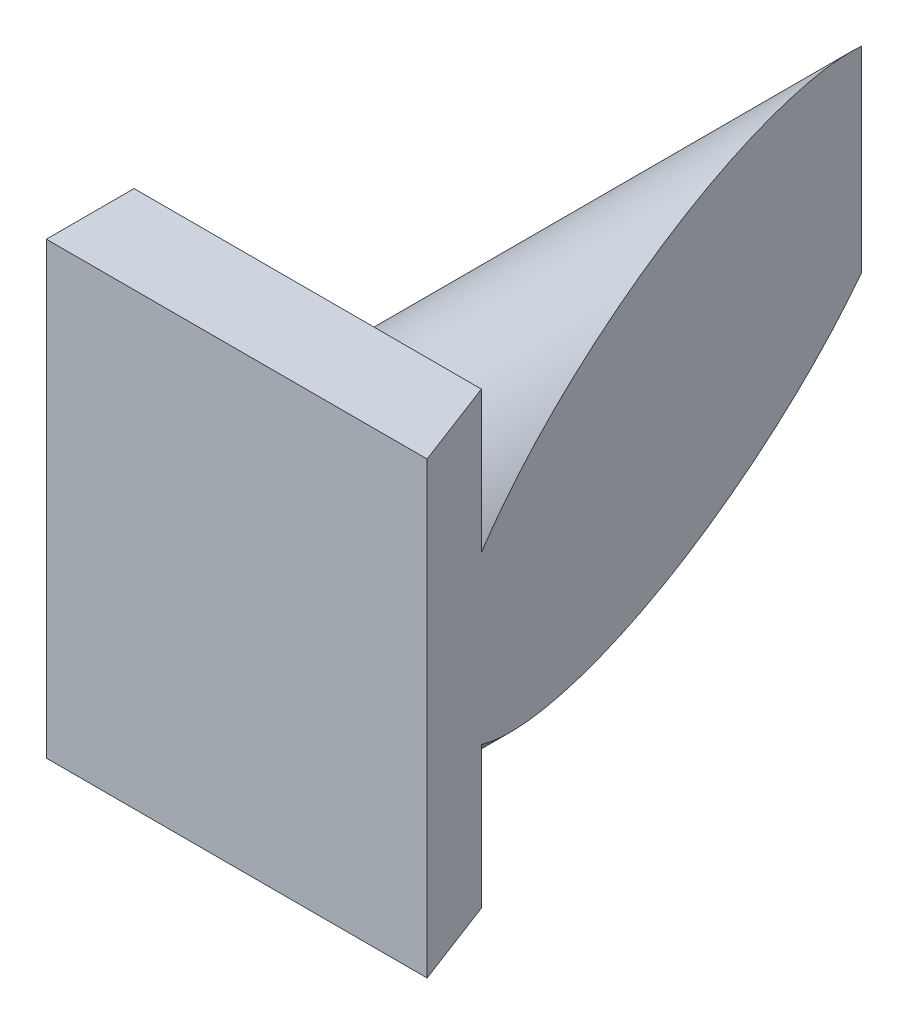
ISO-10303-21;
HEADER;
FILE_DESCRIPTION(('STEP AP214'),'2;1');
FILE_NAME('part.step','',(''),(''),'','','');
FILE_SCHEMA(('AUTOMOTIVE_DESIGN { 1 0 10303 214 1 1 1 1 }'));
ENDSEC;
DATA;
#1=APPLICATION_CONTEXT('core data for automotive mechanical design processes');
#2=APPLICATION_PROTOCOL_DEFINITION('international standard','automotive_design',2000,#1);
#3=PRODUCT_CONTEXT('',#1,'mechanical');
#4=PRODUCT('Part','Part','',(#3));
#5=PRODUCT_RELATED_PRODUCT_CATEGORY('part','',(#4));
#6=PRODUCT_DEFINITION_FORMATION('','',#4);
#7=PRODUCT_DEFINITION_CONTEXT('part definition',#1,'design');
#8=PRODUCT_DEFINITION('design','',#6,#7);
#9=PRODUCT_DEFINITION_SHAPE('','',#8);
#10=(LENGTH_UNIT() NAMED_UNIT(*) SI_UNIT(.MILLI.,.METRE.));
#11=(NAMED_UNIT(*) PLANE_ANGLE_UNIT() SI_UNIT($,.RADIAN.));
#12=(NAMED_UNIT(*) SI_UNIT($,.STERADIAN.) SOLID_ANGLE_UNIT());
#13=UNCERTAINTY_MEASURE_WITH_UNIT(LENGTH_MEASURE(1.E-05),#10,'distance_accuracy_value','');
#14=(GEOMETRIC_REPRESENTATION_CONTEXT(3) GLOBAL_UNCERTAINTY_ASSIGNED_CONTEXT((#13)) GLOBAL_UNIT_ASSIGNED_CONTEXT((#10,
#11,#12)) REPRESENTATION_CONTEXT('',''));
#15=CARTESIAN_POINT('',(0.,0.,0.));
#16=DIRECTION('',(0.,0.,1.));
#17=DIRECTION('',(1.,0.,0.));
#18=AXIS2_PLACEMENT_3D('',#15,#16,#17);
#19=CARTESIAN_POINT('',(-8.12331829174595,-5.92782686154433,70.));
#20=DIRECTION('',(0.,0.,-1.));
#21=DIRECTION('',(-1.,0.,0.));
#22=AXIS2_PLACEMENT_3D('',#19,#20,#21);
#23=CYLINDRICAL_SURFACE('',#22,16.8924483456144);
#24=CARTESIAN_POINT('',(-8.12331829174595,-5.92782686154433,0.));
#25=DIRECTION('',(0.,0.,1.));
#26=DIRECTION('',(1.,0.,0.));
#27=AXIS2_PLACEMENT_3D('',#24,#25,#26);
#28=CIRCLE('',#27,16.8924483456144);
#29=CARTESIAN_POINT('',(-20.7842984279311,5.25494529478507,0.));
#30=VERTEX_POINT('',#29);
#31=CARTESIAN_POINT('',(-20.7842984279311,-17.1105990178737,0.));
#32=VERTEX_POINT('',#31);
#33=EDGE_CURVE('E99',#30,#32,#28,.T.);
#34=ORIENTED_EDGE('',*,*,#33,.T.);
#35=CARTESIAN_POINT('',(-8.12331829174595,-5.92782686154433,33.2632345161307));
#36=DIRECTION('',(-0.934587975133851,0.,0.355732085613892));
#37=DIRECTION('',(-0.355732085613892,0.,-0.934587975133851));
#38=AXIS2_PLACEMENT_3D('',#35,#36,#37);
#39=ELLIPSE('',#38,47.4864343947577,16.8924483456144);
#40=CARTESIAN_POINT('',(5.85979143359973,-15.405561481072,70.));
#41=VERTEX_POINT('',#40);
#42=EDGE_CURVE('E108',#32,#41,#39,.T.);
#43=ORIENTED_EDGE('',*,*,#42,.T.);
#44=CARTESIAN_POINT('',(-8.12331829174595,-5.92782686154433,70.));
#45=DIRECTION('',(0.,0.,1.));
#46=DIRECTION('',(1.,0.,0.));
#47=AXIS2_PLACEMENT_3D('',#44,#45,#46);
#48=CIRCLE('',#47,16.8924483456144);
#49=CARTESIAN_POINT('',(5.85979143359973,3.54990775798338,70.));
#50=VERTEX_POINT('',#49);
#51=EDGE_CURVE('E100',#50,#41,#48,.T.);
#52=ORIENTED_EDGE('',*,*,#51,.F.);
#53=EDGE_CURVE('E48',#50,#30,#39,.T.);
#54=ORIENTED_EDGE('',*,*,#53,.T.);
#55=EDGE_LOOP('',(#34,#43,#52,#54));
#56=FACE_BOUND('',#55,.T.);
#57=ADVANCED_FACE('F34',(#56),#23,.T.);
#58=CARTESIAN_POINT('',(-8.12331829174595,-5.92782686154433,0.));
#59=DIRECTION('',(0.,0.,1.));
#60=DIRECTION('',(1.,0.,0.));
#61=AXIS2_PLACEMENT_3D('',#58,#59,#60);
#62=PLANE('',#61);
#63=ORIENTED_EDGE('',*,*,#33,.F.);
#64=DIRECTION('',(0.,-1.,0.));
#65=VECTOR('',#64,1.);
#66=CARTESIAN_POINT('',(-20.7842984279311,-5.92782686154433,0.));
#67=LINE('',#66,#65);
#68=EDGE_CURVE('E114',#30,#32,#67,.T.);
#69=ORIENTED_EDGE('',*,*,#68,.T.);
#70=EDGE_LOOP('',(#63,#69));
#71=FACE_BOUND('',#70,.T.);
#72=ADVANCED_FACE('F113',(#71),#62,.F.);
#73=CARTESIAN_POINT('',(-33.7478821675263,19.696737014236,80.));
#74=DIRECTION('',(0.,-1.,0.));
#75=DIRECTION('',(0.,0.,-1.));
#76=AXIS2_PLACEMENT_3D('',#73,#74,#75);
#77=PLANE('',#76);
#78=DIRECTION('',(-1.,0.,0.));
#79=VECTOR('',#78,1.);
#80=CARTESIAN_POINT('',(-33.7478821675263,19.696737014236,80.));
#81=LINE('',#80,#79);
#82=CARTESIAN_POINT('',(9.66608998524698,19.696737014236,80.));
#83=VERTEX_POINT('',#82);
#84=CARTESIAN_POINT('',(-33.7478821675263,19.696737014236,80.));
#85=VERTEX_POINT('',#84);
#86=EDGE_CURVE('E93',#83,#85,#81,.T.);
#87=ORIENTED_EDGE('',*,*,#86,.F.);
#88=DIRECTION('',(0.355732085613892,0.,0.934587975133851));
#89=VECTOR('',#88,1.);
#90=CARTESIAN_POINT('',(-25.7122915260126,19.696737014236,-12.9469431554412));
#91=LINE('',#90,#89);
#92=CARTESIAN_POINT('',(5.85979143359973,19.696737014236,70.));
#93=VERTEX_POINT('',#92);
#94=EDGE_CURVE('E127',#93,#83,#91,.T.);
#95=ORIENTED_EDGE('',*,*,#94,.F.);
#96=DIRECTION('',(-1.,0.,0.));
#97=VECTOR('',#96,1.);
#98=CARTESIAN_POINT('',(-33.7478821675263,19.696737014236,70.));
#99=LINE('',#98,#97);
#100=CARTESIAN_POINT('',(-33.7478821675263,19.696737014236,70.));
#101=VERTEX_POINT('',#100);
#102=EDGE_CURVE('E81',#93,#101,#99,.T.);
#103=ORIENTED_EDGE('',*,*,#102,.T.);
#104=DIRECTION('',(0.,0.,-1.));
#105=VECTOR('',#104,1.);
#106=CARTESIAN_POINT('',(-33.7478821675263,19.696737014236,80.));
#107=LINE('',#106,#105);
#108=EDGE_CURVE('E76',#85,#101,#107,.T.);
#109=ORIENTED_EDGE('',*,*,#108,.F.);
#110=EDGE_LOOP('',(#87,#95,#103,#109));
#111=FACE_BOUND('',#110,.T.);
#112=ADVANCED_FACE('F138',(#111),#77,.F.);
#113=CARTESIAN_POINT('',(-33.7478821675263,-31.5523907373247,80.));
#114=DIRECTION('',(1.,0.,0.));
#115=DIRECTION('',(0.,0.,-1.));
#116=AXIS2_PLACEMENT_3D('',#113,#114,#115);
#117=PLANE('',#116);
#118=DIRECTION('',(0.,-1.,0.));
#119=VECTOR('',#118,1.);
#120=CARTESIAN_POINT('',(-33.7478821675263,-31.5523907373247,70.));
#121=LINE('',#120,#119);
#122=CARTESIAN_POINT('',(-33.7478821675263,-31.5523907373247,70.));
#123=VERTEX_POINT('',#122);
#124=EDGE_CURVE('E70',#101,#123,#121,.T.);
#125=ORIENTED_EDGE('',*,*,#124,.T.);
#126=DIRECTION('',(0.,0.,-1.));
#127=VECTOR('',#126,1.);
#128=CARTESIAN_POINT('',(-33.7478821675263,-31.5523907373247,80.));
#129=LINE('',#128,#127);
#130=CARTESIAN_POINT('',(-33.7478821675263,-31.5523907373247,80.));
#131=VERTEX_POINT('',#130);
#132=EDGE_CURVE('E73',#131,#123,#129,.T.);
#133=ORIENTED_EDGE('',*,*,#132,.F.);
#134=DIRECTION('',(0.,-1.,0.));
#135=VECTOR('',#134,1.);
#136=CARTESIAN_POINT('',(-33.7478821675263,-31.5523907373247,80.));
#137=LINE('',#136,#135);
#138=EDGE_CURVE('E57',#85,#131,#137,.T.);
#139=ORIENTED_EDGE('',*,*,#138,.F.);
#140=ORIENTED_EDGE('',*,*,#108,.T.);
#141=EDGE_LOOP('',(#125,#133,#139,#140));
#142=FACE_BOUND('',#141,.T.);
#143=ADVANCED_FACE('F72',(#142),#117,.F.);
#144=CARTESIAN_POINT('',(-33.7478821675263,-31.5523907373247,80.));
#145=DIRECTION('',(0.,1.,0.));
#146=DIRECTION('',(0.,0.,1.));
#147=AXIS2_PLACEMENT_3D('',#144,#145,#146);
#148=PLANE('',#147);
#149=DIRECTION('',(1.,0.,0.));
#150=VECTOR('',#149,1.);
#151=CARTESIAN_POINT('',(-33.7478821675263,-31.5523907373247,70.));
#152=LINE('',#151,#150);
#153=CARTESIAN_POINT('',(5.85979143359973,-31.5523907373247,70.));
#154=VERTEX_POINT('',#153);
#155=EDGE_CURVE('E80',#123,#154,#152,.T.);
#156=ORIENTED_EDGE('',*,*,#155,.T.);
#157=DIRECTION('',(0.355732085613892,0.,0.934587975133851));
#158=VECTOR('',#157,1.);
#159=CARTESIAN_POINT('',(-25.7122915260126,-31.5523907373247,-12.9469431554412));
#160=LINE('',#159,#158);
#161=CARTESIAN_POINT('',(9.66608998524698,-31.5523907373247,80.));
#162=VERTEX_POINT('',#161);
#163=EDGE_CURVE('E122',#154,#162,#160,.T.);
#164=ORIENTED_EDGE('',*,*,#163,.T.);
#165=DIRECTION('',(1.,0.,0.));
#166=VECTOR('',#165,1.);
#167=CARTESIAN_POINT('',(-33.7478821675263,-31.5523907373247,80.));
#168=LINE('',#167,#166);
#169=EDGE_CURVE('E88',#131,#162,#168,.T.);
#170=ORIENTED_EDGE('',*,*,#169,.F.);
#171=ORIENTED_EDGE('',*,*,#132,.T.);
#172=EDGE_LOOP('',(#156,#164,#170,#171));
#173=FACE_BOUND('',#172,.T.);
#174=ADVANCED_FACE('F85',(#173),#148,.F.);
#175=CARTESIAN_POINT('',(0.,0.,80.));
#176=DIRECTION('',(0.,0.,-1.));
#177=DIRECTION('',(-1.,0.,0.));
#178=AXIS2_PLACEMENT_3D('',#175,#176,#177);
#179=PLANE('',#178);
#180=ORIENTED_EDGE('',*,*,#169,.T.);
#181=DIRECTION('',(0.,1.,0.));
#182=VECTOR('',#181,1.);
#183=CARTESIAN_POINT('',(9.66608998524699,0.,80.));
#184=LINE('',#183,#182);
#185=EDGE_CURVE('E125',#162,#83,#184,.T.);
#186=ORIENTED_EDGE('',*,*,#185,.T.);
#187=ORIENTED_EDGE('',*,*,#86,.T.);
#188=ORIENTED_EDGE('',*,*,#138,.T.);
#189=EDGE_LOOP('',(#180,#186,#187,#188));
#190=FACE_BOUND('',#189,.T.);
#191=ADVANCED_FACE('F142',(#190),#179,.F.);
#192=CARTESIAN_POINT('',(0.,0.,70.));
#193=DIRECTION('',(0.,0.,-1.));
#194=DIRECTION('',(-1.,0.,0.));
#195=AXIS2_PLACEMENT_3D('',#192,#193,#194);
#196=PLANE('',#195);
#197=DIRECTION('',(0.,1.,0.));
#198=VECTOR('',#197,1.);
#199=CARTESIAN_POINT('',(5.85979143359973,0.,70.));
#200=LINE('',#199,#198);
#201=EDGE_CURVE('E11',#154,#41,#200,.T.);
#202=ORIENTED_EDGE('',*,*,#201,.F.);
#203=ORIENTED_EDGE('',*,*,#155,.F.);
#204=ORIENTED_EDGE('',*,*,#124,.F.);
#205=ORIENTED_EDGE('',*,*,#102,.F.);
#206=EDGE_CURVE('E37',#50,#93,#200,.T.);
#207=ORIENTED_EDGE('',*,*,#206,.F.);
#208=ORIENTED_EDGE('',*,*,#51,.T.);
#209=EDGE_LOOP('',(#202,#203,#204,#205,#207,#208));
#210=FACE_BOUND('',#209,.T.);
#211=ADVANCED_FACE('F91',(#210),#196,.T.);
#212=CARTESIAN_POINT('',(-25.7122915260126,-31.5523907373247,-12.9469431554412));
#213=DIRECTION('',(-0.934587975133851,0.,0.355732085613892));
#214=DIRECTION('',(0.355732085613892,0.,0.934587975133851));
#215=AXIS2_PLACEMENT_3D('',#212,#213,#214);
#216=PLANE('',#215);
#217=ORIENTED_EDGE('',*,*,#163,.F.);
#218=ORIENTED_EDGE('',*,*,#201,.T.);
#219=ORIENTED_EDGE('',*,*,#42,.F.);
#220=ORIENTED_EDGE('',*,*,#68,.F.);
#221=ORIENTED_EDGE('',*,*,#53,.F.);
#222=ORIENTED_EDGE('',*,*,#206,.T.);
#223=ORIENTED_EDGE('',*,*,#94,.T.);
#224=ORIENTED_EDGE('',*,*,#185,.F.);
#225=EDGE_LOOP('',(#217,#218,#219,#220,#221,#222,#223,#224));
#226=FACE_BOUND('',#225,.T.);
#227=ADVANCED_FACE('F121',(#226),#216,.F.);
#228=CLOSED_SHELL('',(#57,#72,#112,#143,#174,#191,#211,#227));
#229=MANIFOLD_SOLID_BREP('B2',#228);
#230=ADVANCED_BREP_SHAPE_REPRESENTATION('',(#18,#229),#14);
#231=SHAPE_DEFINITION_REPRESENTATION(#9,#230);
ENDSEC;
END-ISO-10303-21;
